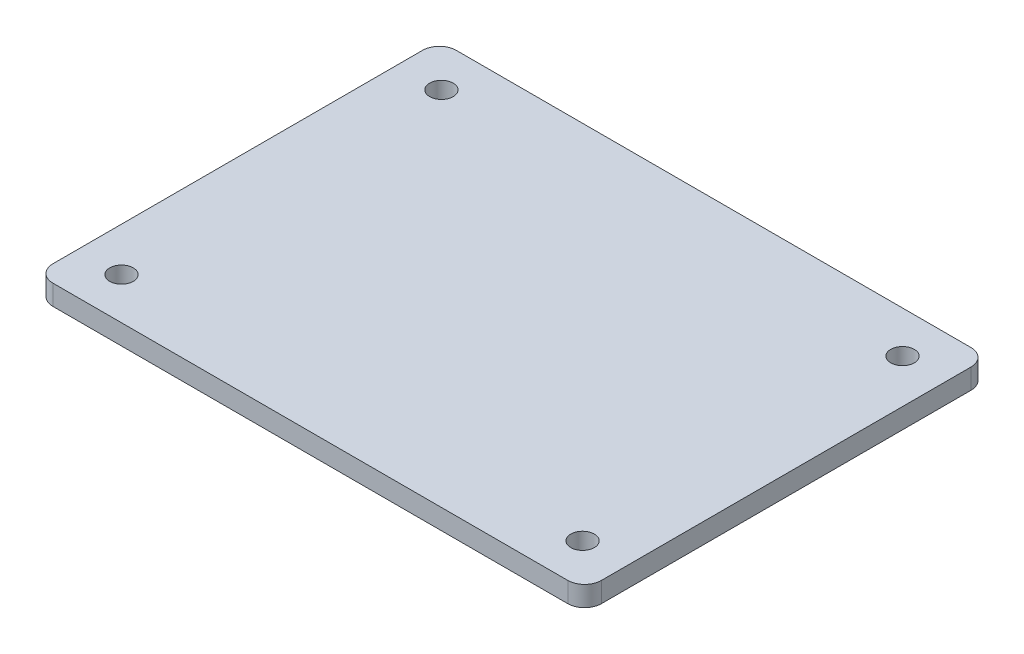
ISO-10303-21;
HEADER;
FILE_DESCRIPTION(('STEP AP214'),'2;1');
FILE_NAME('part.step','',(''),(''),'','','');
FILE_SCHEMA(('AUTOMOTIVE_DESIGN { 1 0 10303 214 1 1 1 1 }'));
ENDSEC;
DATA;
#1=APPLICATION_CONTEXT('core data for automotive mechanical design processes');
#2=APPLICATION_PROTOCOL_DEFINITION('international standard','automotive_design',2000,#1);
#3=PRODUCT_CONTEXT('',#1,'mechanical');
#4=PRODUCT('Part','Part','',(#3));
#5=PRODUCT_RELATED_PRODUCT_CATEGORY('part','',(#4));
#6=PRODUCT_DEFINITION_FORMATION('','',#4);
#7=PRODUCT_DEFINITION_CONTEXT('part definition',#1,'design');
#8=PRODUCT_DEFINITION('design','',#6,#7);
#9=PRODUCT_DEFINITION_SHAPE('','',#8);
#10=(LENGTH_UNIT() NAMED_UNIT(*) SI_UNIT(.MILLI.,.METRE.));
#11=(NAMED_UNIT(*) PLANE_ANGLE_UNIT() SI_UNIT($,.RADIAN.));
#12=(NAMED_UNIT(*) SI_UNIT($,.STERADIAN.) SOLID_ANGLE_UNIT());
#13=UNCERTAINTY_MEASURE_WITH_UNIT(LENGTH_MEASURE(1.E-05),#10,'distance_accuracy_value','');
#14=(GEOMETRIC_REPRESENTATION_CONTEXT(3) GLOBAL_UNCERTAINTY_ASSIGNED_CONTEXT((#13)) GLOBAL_UNIT_ASSIGNED_CONTEXT((#10,
#11,#12)) REPRESENTATION_CONTEXT('',''));
#15=CARTESIAN_POINT('',(0.,0.,0.));
#16=DIRECTION('',(0.,0.,1.));
#17=DIRECTION('',(1.,0.,0.));
#18=AXIS2_PLACEMENT_3D('',#15,#16,#17);
#19=CARTESIAN_POINT('',(-38.3,3.,27.5));
#20=DIRECTION('',(0.,-1.,0.));
#21=DIRECTION('',(0.,0.,-1.));
#22=AXIS2_PLACEMENT_3D('',#19,#20,#21);
#23=PLANE('',#22);
#24=CARTESIAN_POINT('',(-38.3,3.,27.5));
#25=DIRECTION('',(0.,1.,0.));
#26=DIRECTION('',(0.,0.,-1.));
#27=AXIS2_PLACEMENT_3D('',#24,#25,#26);
#28=CIRCLE('',#27,2.5);
#29=CARTESIAN_POINT('',(-40.8,3.,27.5));
#30=VERTEX_POINT('',#29);
#31=CARTESIAN_POINT('',(-38.3,3.,30.));
#32=VERTEX_POINT('',#31);
#33=EDGE_CURVE('E145',#30,#32,#28,.T.);
#34=ORIENTED_EDGE('',*,*,#33,.T.);
#35=DIRECTION('',(1.,0.,0.));
#36=VECTOR('',#35,1.);
#37=CARTESIAN_POINT('',(-38.3,3.,30.));
#38=LINE('',#37,#36);
#39=CARTESIAN_POINT('',(38.3,3.,30.));
#40=VERTEX_POINT('',#39);
#41=EDGE_CURVE('E93',#32,#40,#38,.T.);
#42=ORIENTED_EDGE('',*,*,#41,.T.);
#43=CARTESIAN_POINT('',(38.3,3.,27.5));
#44=DIRECTION('',(0.,1.,0.));
#45=DIRECTION('',(0.,0.,1.));
#46=AXIS2_PLACEMENT_3D('',#43,#44,#45);
#47=CIRCLE('',#46,2.5);
#48=CARTESIAN_POINT('',(40.8,3.,27.5));
#49=VERTEX_POINT('',#48);
#50=EDGE_CURVE('E160',#40,#49,#47,.T.);
#51=ORIENTED_EDGE('',*,*,#50,.T.);
#52=DIRECTION('',(0.,0.,-1.));
#53=VECTOR('',#52,1.);
#54=CARTESIAN_POINT('',(40.8,3.,27.5));
#55=LINE('',#54,#53);
#56=CARTESIAN_POINT('',(40.8,3.,-27.5));
#57=VERTEX_POINT('',#56);
#58=EDGE_CURVE('E173',#49,#57,#55,.T.);
#59=ORIENTED_EDGE('',*,*,#58,.T.);
#60=CARTESIAN_POINT('',(38.3,3.,-27.5));
#61=DIRECTION('',(0.,1.,0.));
#62=DIRECTION('',(0.,0.,-1.));
#63=AXIS2_PLACEMENT_3D('',#60,#61,#62);
#64=CIRCLE('',#63,2.5);
#65=CARTESIAN_POINT('',(38.3,3.,-30.));
#66=VERTEX_POINT('',#65);
#67=EDGE_CURVE('E112',#57,#66,#64,.T.);
#68=ORIENTED_EDGE('',*,*,#67,.T.);
#69=DIRECTION('',(-1.,0.,0.));
#70=VECTOR('',#69,1.);
#71=CARTESIAN_POINT('',(-38.3,3.,-30.));
#72=LINE('',#71,#70);
#73=CARTESIAN_POINT('',(-38.3,3.,-30.));
#74=VERTEX_POINT('',#73);
#75=EDGE_CURVE('E106',#66,#74,#72,.T.);
#76=ORIENTED_EDGE('',*,*,#75,.T.);
#77=CARTESIAN_POINT('',(-38.3,3.,-27.5));
#78=DIRECTION('',(0.,1.,0.));
#79=DIRECTION('',(0.,0.,-1.));
#80=AXIS2_PLACEMENT_3D('',#77,#78,#79);
#81=CIRCLE('',#80,2.5);
#82=CARTESIAN_POINT('',(-40.8,3.,-27.5));
#83=VERTEX_POINT('',#82);
#84=EDGE_CURVE('E110',#74,#83,#81,.T.);
#85=ORIENTED_EDGE('',*,*,#84,.T.);
#86=DIRECTION('',(0.,0.,1.));
#87=VECTOR('',#86,1.);
#88=CARTESIAN_POINT('',(-40.8,3.,27.5));
#89=LINE('',#88,#87);
#90=EDGE_CURVE('E50',#83,#30,#89,.T.);
#91=ORIENTED_EDGE('',*,*,#90,.T.);
#92=EDGE_LOOP('',(#34,#42,#51,#59,#68,#76,#85,#91));
#93=FACE_BOUND('',#92,.T.);
#94=CARTESIAN_POINT('',(-34.3,3.,-23.8));
#95=DIRECTION('',(0.,1.,0.));
#96=DIRECTION('',(0.,0.,1.));
#97=AXIS2_PLACEMENT_3D('',#94,#95,#96);
#98=CIRCLE('',#97,1.75);
#99=CARTESIAN_POINT('',(-34.3,3.,-22.05));
#100=VERTEX_POINT('',#99);
#101=EDGE_CURVE('E134',#100,#100,#98,.T.);
#102=ORIENTED_EDGE('',*,*,#101,.F.);
#103=EDGE_LOOP('',(#102));
#104=FACE_BOUND('',#103,.T.);
#105=CARTESIAN_POINT('',(-34.3,3.,23.8));
#106=DIRECTION('',(0.,1.,0.));
#107=DIRECTION('',(0.,0.,-1.));
#108=AXIS2_PLACEMENT_3D('',#105,#106,#107);
#109=CIRCLE('',#108,1.75);
#110=CARTESIAN_POINT('',(-34.3,3.,22.05));
#111=VERTEX_POINT('',#110);
#112=EDGE_CURVE('E182',#111,#111,#109,.T.);
#113=ORIENTED_EDGE('',*,*,#112,.F.);
#114=EDGE_LOOP('',(#113));
#115=FACE_BOUND('',#114,.T.);
#116=CARTESIAN_POINT('',(34.3000000000002,3.,23.7999999999998));
#117=DIRECTION('',(0.,1.,0.));
#118=DIRECTION('',(0.,0.,1.));
#119=AXIS2_PLACEMENT_3D('',#116,#117,#118);
#120=CIRCLE('',#119,1.75);
#121=CARTESIAN_POINT('',(34.3000000000002,3.,25.5499999999998));
#122=VERTEX_POINT('',#121);
#123=EDGE_CURVE('E188',#122,#122,#120,.T.);
#124=ORIENTED_EDGE('',*,*,#123,.F.);
#125=EDGE_LOOP('',(#124));
#126=FACE_BOUND('',#125,.T.);
#127=CARTESIAN_POINT('',(34.2999999999998,3.,-23.8000000000004));
#128=DIRECTION('',(0.,1.,0.));
#129=DIRECTION('',(0.,0.,-1.));
#130=AXIS2_PLACEMENT_3D('',#127,#128,#129);
#131=CIRCLE('',#130,1.75);
#132=CARTESIAN_POINT('',(34.2999999999998,3.,-25.5500000000005));
#133=VERTEX_POINT('',#132);
#134=EDGE_CURVE('E194',#133,#133,#131,.T.);
#135=ORIENTED_EDGE('',*,*,#134,.F.);
#136=EDGE_LOOP('',(#135));
#137=FACE_BOUND('',#136,.T.);
#138=ADVANCED_FACE('F33',(#93,#104,#115,#126,#137),#23,.F.);
#139=CARTESIAN_POINT('',(-38.3,0.,27.5));
#140=DIRECTION('',(0.,-1.,0.));
#141=DIRECTION('',(0.,0.,-1.));
#142=AXIS2_PLACEMENT_3D('',#139,#140,#141);
#143=PLANE('',#142);
#144=CARTESIAN_POINT('',(34.3000000000002,0.,23.7999999999998));
#145=DIRECTION('',(0.,1.,0.));
#146=DIRECTION('',(0.,0.,1.));
#147=AXIS2_PLACEMENT_3D('',#144,#145,#146);
#148=CIRCLE('',#147,1.75);
#149=CARTESIAN_POINT('',(34.3000000000002,0.,25.5499999999998));
#150=VERTEX_POINT('',#149);
#151=EDGE_CURVE('E191',#150,#150,#148,.T.);
#152=ORIENTED_EDGE('',*,*,#151,.T.);
#153=EDGE_LOOP('',(#152));
#154=FACE_BOUND('',#153,.T.);
#155=CARTESIAN_POINT('',(-34.3,0.,-23.8));
#156=DIRECTION('',(0.,1.,0.));
#157=DIRECTION('',(0.,0.,1.));
#158=AXIS2_PLACEMENT_3D('',#155,#156,#157);
#159=CIRCLE('',#158,1.75);
#160=CARTESIAN_POINT('',(-34.3,0.,-22.05));
#161=VERTEX_POINT('',#160);
#162=EDGE_CURVE('E179',#161,#161,#159,.T.);
#163=ORIENTED_EDGE('',*,*,#162,.T.);
#164=EDGE_LOOP('',(#163));
#165=FACE_BOUND('',#164,.T.);
#166=CARTESIAN_POINT('',(-38.3,0.,27.5));
#167=DIRECTION('',(0.,1.,0.));
#168=DIRECTION('',(0.,0.,-1.));
#169=AXIS2_PLACEMENT_3D('',#166,#167,#168);
#170=CIRCLE('',#169,2.5);
#171=CARTESIAN_POINT('',(-40.8,0.,27.5));
#172=VERTEX_POINT('',#171);
#173=CARTESIAN_POINT('',(-38.3,0.,30.));
#174=VERTEX_POINT('',#173);
#175=EDGE_CURVE('E130',#172,#174,#170,.T.);
#176=ORIENTED_EDGE('',*,*,#175,.F.);
#177=DIRECTION('',(0.,0.,1.));
#178=VECTOR('',#177,1.);
#179=CARTESIAN_POINT('',(-40.8,0.,27.5));
#180=LINE('',#179,#178);
#181=CARTESIAN_POINT('',(-40.8,0.,-27.5));
#182=VERTEX_POINT('',#181);
#183=EDGE_CURVE('E85',#182,#172,#180,.T.);
#184=ORIENTED_EDGE('',*,*,#183,.F.);
#185=CARTESIAN_POINT('',(-38.3,0.,-27.5));
#186=DIRECTION('',(0.,1.,0.));
#187=DIRECTION('',(0.,0.,-1.));
#188=AXIS2_PLACEMENT_3D('',#185,#186,#187);
#189=CIRCLE('',#188,2.5);
#190=CARTESIAN_POINT('',(-38.3,0.,-30.));
#191=VERTEX_POINT('',#190);
#192=EDGE_CURVE('E79',#191,#182,#189,.T.);
#193=ORIENTED_EDGE('',*,*,#192,.F.);
#194=DIRECTION('',(-1.,0.,0.));
#195=VECTOR('',#194,1.);
#196=CARTESIAN_POINT('',(-38.3,0.,-30.));
#197=LINE('',#196,#195);
#198=CARTESIAN_POINT('',(38.3,0.,-30.));
#199=VERTEX_POINT('',#198);
#200=EDGE_CURVE('E120',#199,#191,#197,.T.);
#201=ORIENTED_EDGE('',*,*,#200,.F.);
#202=CARTESIAN_POINT('',(38.3,0.,-27.5));
#203=DIRECTION('',(0.,1.,0.));
#204=DIRECTION('',(0.,0.,-1.));
#205=AXIS2_PLACEMENT_3D('',#202,#203,#204);
#206=CIRCLE('',#205,2.5);
#207=CARTESIAN_POINT('',(40.8,0.,-27.5));
#208=VERTEX_POINT('',#207);
#209=EDGE_CURVE('E140',#208,#199,#206,.T.);
#210=ORIENTED_EDGE('',*,*,#209,.F.);
#211=DIRECTION('',(0.,0.,-1.));
#212=VECTOR('',#211,1.);
#213=CARTESIAN_POINT('',(40.8,0.,27.5));
#214=LINE('',#213,#212);
#215=CARTESIAN_POINT('',(40.8,0.,27.5));
#216=VERTEX_POINT('',#215);
#217=EDGE_CURVE('E138',#216,#208,#214,.T.);
#218=ORIENTED_EDGE('',*,*,#217,.F.);
#219=CARTESIAN_POINT('',(38.3,0.,27.5));
#220=DIRECTION('',(0.,1.,0.));
#221=DIRECTION('',(0.,0.,1.));
#222=AXIS2_PLACEMENT_3D('',#219,#220,#221);
#223=CIRCLE('',#222,2.5);
#224=CARTESIAN_POINT('',(38.3,0.,30.));
#225=VERTEX_POINT('',#224);
#226=EDGE_CURVE('E136',#225,#216,#223,.T.);
#227=ORIENTED_EDGE('',*,*,#226,.F.);
#228=DIRECTION('',(1.,0.,0.));
#229=VECTOR('',#228,1.);
#230=CARTESIAN_POINT('',(-38.3,0.,30.));
#231=LINE('',#230,#229);
#232=EDGE_CURVE('E133',#174,#225,#231,.T.);
#233=ORIENTED_EDGE('',*,*,#232,.F.);
#234=EDGE_LOOP('',(#176,#184,#193,#201,#210,#218,#227,#233));
#235=FACE_BOUND('',#234,.T.);
#236=CARTESIAN_POINT('',(-34.3,0.,23.8));
#237=DIRECTION('',(0.,1.,0.));
#238=DIRECTION('',(0.,0.,-1.));
#239=AXIS2_PLACEMENT_3D('',#236,#237,#238);
#240=CIRCLE('',#239,1.75);
#241=CARTESIAN_POINT('',(-34.3,0.,22.05));
#242=VERTEX_POINT('',#241);
#243=EDGE_CURVE('E185',#242,#242,#240,.T.);
#244=ORIENTED_EDGE('',*,*,#243,.T.);
#245=EDGE_LOOP('',(#244));
#246=FACE_BOUND('',#245,.T.);
#247=CARTESIAN_POINT('',(34.2999999999998,0.,-23.8000000000004));
#248=DIRECTION('',(0.,1.,0.));
#249=DIRECTION('',(0.,0.,-1.));
#250=AXIS2_PLACEMENT_3D('',#247,#248,#249);
#251=CIRCLE('',#250,1.75);
#252=CARTESIAN_POINT('',(34.2999999999998,0.,-25.5500000000005));
#253=VERTEX_POINT('',#252);
#254=EDGE_CURVE('E197',#253,#253,#251,.T.);
#255=ORIENTED_EDGE('',*,*,#254,.T.);
#256=EDGE_LOOP('',(#255));
#257=FACE_BOUND('',#256,.T.);
#258=ADVANCED_FACE('F164',(#154,#165,#235,#246,#257),#143,.T.);
#259=CARTESIAN_POINT('',(-38.3,3.,27.5));
#260=DIRECTION('',(0.,-1.,0.));
#261=DIRECTION('',(0.,0.,-1.));
#262=AXIS2_PLACEMENT_3D('',#259,#260,#261);
#263=CYLINDRICAL_SURFACE('',#262,2.5);
#264=ORIENTED_EDGE('',*,*,#175,.T.);
#265=DIRECTION('',(0.,-1.,0.));
#266=VECTOR('',#265,1.);
#267=CARTESIAN_POINT('',(-38.3,3.,30.));
#268=LINE('',#267,#266);
#269=EDGE_CURVE('E11',#32,#174,#268,.T.);
#270=ORIENTED_EDGE('',*,*,#269,.F.);
#271=ORIENTED_EDGE('',*,*,#33,.F.);
#272=DIRECTION('',(0.,-1.,0.));
#273=VECTOR('',#272,1.);
#274=CARTESIAN_POINT('',(-40.8,3.,27.5));
#275=LINE('',#274,#273);
#276=EDGE_CURVE('E126',#30,#172,#275,.T.);
#277=ORIENTED_EDGE('',*,*,#276,.T.);
#278=EDGE_LOOP('',(#264,#270,#271,#277));
#279=FACE_BOUND('',#278,.T.);
#280=ADVANCED_FACE('F35',(#279),#263,.T.);
#281=CARTESIAN_POINT('',(-38.3,3.,30.));
#282=DIRECTION('',(0.,0.,-1.));
#283=DIRECTION('',(-1.,0.,0.));
#284=AXIS2_PLACEMENT_3D('',#281,#282,#283);
#285=PLANE('',#284);
#286=ORIENTED_EDGE('',*,*,#232,.T.);
#287=DIRECTION('',(0.,-1.,0.));
#288=VECTOR('',#287,1.);
#289=CARTESIAN_POINT('',(38.3,3.,30.));
#290=LINE('',#289,#288);
#291=EDGE_CURVE('E42',#40,#225,#290,.T.);
#292=ORIENTED_EDGE('',*,*,#291,.F.);
#293=ORIENTED_EDGE('',*,*,#41,.F.);
#294=ORIENTED_EDGE('',*,*,#269,.T.);
#295=EDGE_LOOP('',(#286,#292,#293,#294));
#296=FACE_BOUND('',#295,.T.);
#297=ADVANCED_FACE('F229',(#296),#285,.F.);
#298=CARTESIAN_POINT('',(38.3,3.,27.5));
#299=DIRECTION('',(0.,-1.,0.));
#300=DIRECTION('',(0.,0.,-1.));
#301=AXIS2_PLACEMENT_3D('',#298,#299,#300);
#302=CYLINDRICAL_SURFACE('',#301,2.5);
#303=ORIENTED_EDGE('',*,*,#226,.T.);
#304=DIRECTION('',(0.,-1.,0.));
#305=VECTOR('',#304,1.);
#306=CARTESIAN_POINT('',(40.8,3.,27.5));
#307=LINE('',#306,#305);
#308=EDGE_CURVE('E152',#49,#216,#307,.T.);
#309=ORIENTED_EDGE('',*,*,#308,.F.);
#310=ORIENTED_EDGE('',*,*,#50,.F.);
#311=ORIENTED_EDGE('',*,*,#291,.T.);
#312=EDGE_LOOP('',(#303,#309,#310,#311));
#313=FACE_BOUND('',#312,.T.);
#314=ADVANCED_FACE('F158',(#313),#302,.T.);
#315=CARTESIAN_POINT('',(40.8,3.,27.5));
#316=DIRECTION('',(-1.,0.,0.));
#317=DIRECTION('',(0.,0.,1.));
#318=AXIS2_PLACEMENT_3D('',#315,#316,#317);
#319=PLANE('',#318);
#320=ORIENTED_EDGE('',*,*,#217,.T.);
#321=DIRECTION('',(0.,-1.,0.));
#322=VECTOR('',#321,1.);
#323=CARTESIAN_POINT('',(40.8,3.,-27.5));
#324=LINE('',#323,#322);
#325=EDGE_CURVE('E149',#57,#208,#324,.T.);
#326=ORIENTED_EDGE('',*,*,#325,.F.);
#327=ORIENTED_EDGE('',*,*,#58,.F.);
#328=ORIENTED_EDGE('',*,*,#308,.T.);
#329=EDGE_LOOP('',(#320,#326,#327,#328));
#330=FACE_BOUND('',#329,.T.);
#331=ADVANCED_FACE('F169',(#330),#319,.F.);
#332=CARTESIAN_POINT('',(38.3,3.,-27.5));
#333=DIRECTION('',(0.,-1.,0.));
#334=DIRECTION('',(0.,0.,-1.));
#335=AXIS2_PLACEMENT_3D('',#332,#333,#334);
#336=CYLINDRICAL_SURFACE('',#335,2.5);
#337=ORIENTED_EDGE('',*,*,#209,.T.);
#338=DIRECTION('',(0.,-1.,0.));
#339=VECTOR('',#338,1.);
#340=CARTESIAN_POINT('',(38.3,3.,-30.));
#341=LINE('',#340,#339);
#342=EDGE_CURVE('E121',#66,#199,#341,.T.);
#343=ORIENTED_EDGE('',*,*,#342,.F.);
#344=ORIENTED_EDGE('',*,*,#67,.F.);
#345=ORIENTED_EDGE('',*,*,#325,.T.);
#346=EDGE_LOOP('',(#337,#343,#344,#345));
#347=FACE_BOUND('',#346,.T.);
#348=ADVANCED_FACE('F172',(#347),#336,.T.);
#349=CARTESIAN_POINT('',(-38.3,3.,-30.));
#350=DIRECTION('',(0.,0.,1.));
#351=DIRECTION('',(1.,0.,0.));
#352=AXIS2_PLACEMENT_3D('',#349,#350,#351);
#353=PLANE('',#352);
#354=ORIENTED_EDGE('',*,*,#200,.T.);
#355=DIRECTION('',(0.,-1.,0.));
#356=VECTOR('',#355,1.);
#357=CARTESIAN_POINT('',(-38.3,3.,-30.));
#358=LINE('',#357,#356);
#359=EDGE_CURVE('E117',#74,#191,#358,.T.);
#360=ORIENTED_EDGE('',*,*,#359,.F.);
#361=ORIENTED_EDGE('',*,*,#75,.F.);
#362=ORIENTED_EDGE('',*,*,#342,.T.);
#363=EDGE_LOOP('',(#354,#360,#361,#362));
#364=FACE_BOUND('',#363,.T.);
#365=ADVANCED_FACE('F118',(#364),#353,.F.);
#366=CARTESIAN_POINT('',(-38.3,3.,-27.5));
#367=DIRECTION('',(0.,-1.,0.));
#368=DIRECTION('',(0.,0.,-1.));
#369=AXIS2_PLACEMENT_3D('',#366,#367,#368);
#370=CYLINDRICAL_SURFACE('',#369,2.5);
#371=ORIENTED_EDGE('',*,*,#192,.T.);
#372=DIRECTION('',(0.,-1.,0.));
#373=VECTOR('',#372,1.);
#374=CARTESIAN_POINT('',(-40.8,3.,-27.5));
#375=LINE('',#374,#373);
#376=EDGE_CURVE('E122',#83,#182,#375,.T.);
#377=ORIENTED_EDGE('',*,*,#376,.F.);
#378=ORIENTED_EDGE('',*,*,#84,.F.);
#379=ORIENTED_EDGE('',*,*,#359,.T.);
#380=EDGE_LOOP('',(#371,#377,#378,#379));
#381=FACE_BOUND('',#380,.T.);
#382=ADVANCED_FACE('F124',(#381),#370,.T.);
#383=CARTESIAN_POINT('',(-40.8,3.,27.5));
#384=DIRECTION('',(1.,0.,0.));
#385=DIRECTION('',(0.,0.,-1.));
#386=AXIS2_PLACEMENT_3D('',#383,#384,#385);
#387=PLANE('',#386);
#388=ORIENTED_EDGE('',*,*,#183,.T.);
#389=ORIENTED_EDGE('',*,*,#276,.F.);
#390=ORIENTED_EDGE('',*,*,#90,.F.);
#391=ORIENTED_EDGE('',*,*,#376,.T.);
#392=EDGE_LOOP('',(#388,#389,#390,#391));
#393=FACE_BOUND('',#392,.T.);
#394=ADVANCED_FACE('F217',(#393),#387,.F.);
#395=CARTESIAN_POINT('',(-34.3,3.,-23.8));
#396=DIRECTION('',(0.,-1.,0.));
#397=DIRECTION('',(0.,0.,-1.));
#398=AXIS2_PLACEMENT_3D('',#395,#396,#397);
#399=CYLINDRICAL_SURFACE('',#398,1.75);
#400=ORIENTED_EDGE('',*,*,#101,.T.);
#401=EDGE_LOOP('',(#400));
#402=FACE_BOUND('',#401,.T.);
#403=ORIENTED_EDGE('',*,*,#162,.F.);
#404=EDGE_LOOP('',(#403));
#405=FACE_BOUND('',#404,.T.);
#406=ADVANCED_FACE('F214',(#402,#405),#399,.F.);
#407=CARTESIAN_POINT('',(-34.3,3.,23.8));
#408=DIRECTION('',(0.,-1.,0.));
#409=DIRECTION('',(0.,0.,-1.));
#410=AXIS2_PLACEMENT_3D('',#407,#408,#409);
#411=CYLINDRICAL_SURFACE('',#410,1.75);
#412=ORIENTED_EDGE('',*,*,#112,.T.);
#413=EDGE_LOOP('',(#412));
#414=FACE_BOUND('',#413,.T.);
#415=ORIENTED_EDGE('',*,*,#243,.F.);
#416=EDGE_LOOP('',(#415));
#417=FACE_BOUND('',#416,.T.);
#418=ADVANCED_FACE('F293',(#414,#417),#411,.F.);
#419=CARTESIAN_POINT('',(34.3000000000002,3.,23.7999999999998));
#420=DIRECTION('',(0.,-1.,0.));
#421=DIRECTION('',(0.,0.,-1.));
#422=AXIS2_PLACEMENT_3D('',#419,#420,#421);
#423=CYLINDRICAL_SURFACE('',#422,1.75);
#424=ORIENTED_EDGE('',*,*,#123,.T.);
#425=EDGE_LOOP('',(#424));
#426=FACE_BOUND('',#425,.T.);
#427=ORIENTED_EDGE('',*,*,#151,.F.);
#428=EDGE_LOOP('',(#427));
#429=FACE_BOUND('',#428,.T.);
#430=ADVANCED_FACE('F301',(#426,#429),#423,.F.);
#431=CARTESIAN_POINT('',(34.2999999999998,3.,-23.8000000000004));
#432=DIRECTION('',(0.,-1.,0.));
#433=DIRECTION('',(0.,0.,-1.));
#434=AXIS2_PLACEMENT_3D('',#431,#432,#433);
#435=CYLINDRICAL_SURFACE('',#434,1.75);
#436=ORIENTED_EDGE('',*,*,#134,.T.);
#437=EDGE_LOOP('',(#436));
#438=FACE_BOUND('',#437,.T.);
#439=ORIENTED_EDGE('',*,*,#254,.F.);
#440=EDGE_LOOP('',(#439));
#441=FACE_BOUND('',#440,.T.);
#442=ADVANCED_FACE('F203',(#438,#441),#435,.F.);
#443=CLOSED_SHELL('',(#138,#258,#280,#297,#314,#331,#348,#365,#382,#394,#406,#418,#430,#442));
#444=MANIFOLD_SOLID_BREP('B2',#443);
#445=ADVANCED_BREP_SHAPE_REPRESENTATION('',(#18,#444),#14);
#446=SHAPE_DEFINITION_REPRESENTATION(#9,#445);
ENDSEC;
END-ISO-10303-21;
